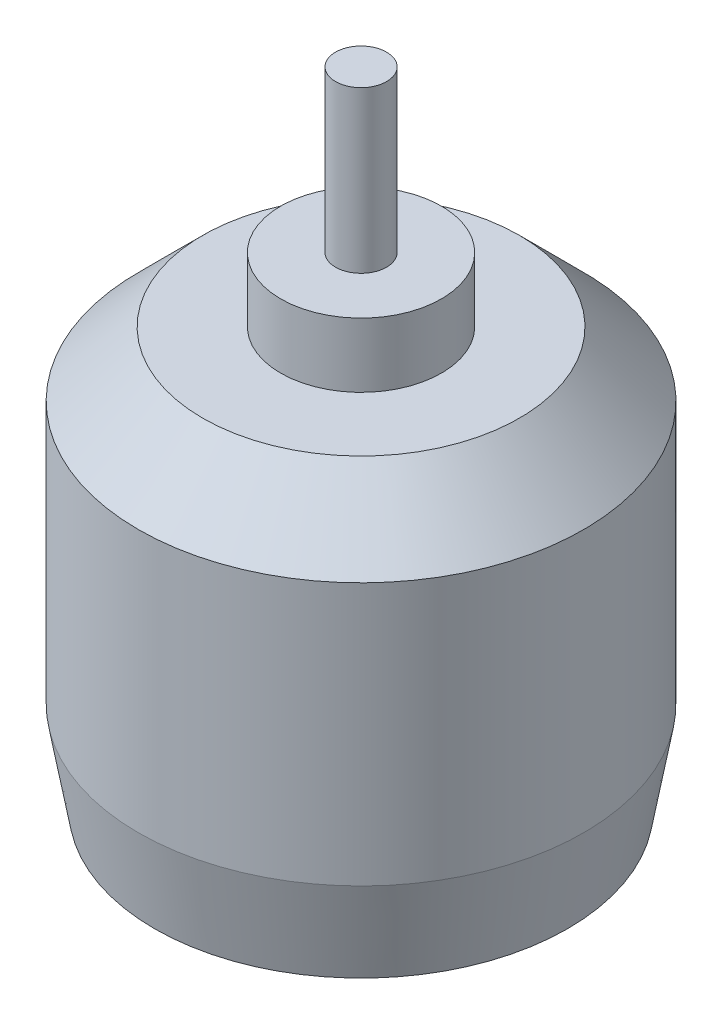
ISO-10303-21;
HEADER;
FILE_DESCRIPTION(('STEP AP214'),'2;1');
FILE_NAME('part.step','',(''),(''),'','','');
FILE_SCHEMA(('AUTOMOTIVE_DESIGN { 1 0 10303 214 1 1 1 1 }'));
ENDSEC;
DATA;
#1=APPLICATION_CONTEXT('core data for automotive mechanical design processes');
#2=APPLICATION_PROTOCOL_DEFINITION('international standard','automotive_design',2000,#1);
#3=PRODUCT_CONTEXT('',#1,'mechanical');
#4=PRODUCT('Part','Part','',(#3));
#5=PRODUCT_RELATED_PRODUCT_CATEGORY('part','',(#4));
#6=PRODUCT_DEFINITION_FORMATION('','',#4);
#7=PRODUCT_DEFINITION_CONTEXT('part definition',#1,'design');
#8=PRODUCT_DEFINITION('design','',#6,#7);
#9=PRODUCT_DEFINITION_SHAPE('','',#8);
#10=(LENGTH_UNIT() NAMED_UNIT(*) SI_UNIT(.MILLI.,.METRE.));
#11=(NAMED_UNIT(*) PLANE_ANGLE_UNIT() SI_UNIT($,.RADIAN.));
#12=(NAMED_UNIT(*) SI_UNIT($,.STERADIAN.) SOLID_ANGLE_UNIT());
#13=UNCERTAINTY_MEASURE_WITH_UNIT(LENGTH_MEASURE(1.E-05),#10,'distance_accuracy_value','');
#14=(GEOMETRIC_REPRESENTATION_CONTEXT(3) GLOBAL_UNCERTAINTY_ASSIGNED_CONTEXT((#13)) GLOBAL_UNIT_ASSIGNED_CONTEXT((#10,
#11,#12)) REPRESENTATION_CONTEXT('',''));
#15=CARTESIAN_POINT('',(0.,0.,0.));
#16=DIRECTION('',(0.,0.,1.));
#17=DIRECTION('',(1.,0.,0.));
#18=AXIS2_PLACEMENT_3D('',#15,#16,#17);
#19=CARTESIAN_POINT('',(0.,26.,0.));
#20=DIRECTION('',(0.,-1.,0.));
#21=DIRECTION('',(0.,0.,-1.));
#22=AXIS2_PLACEMENT_3D('',#19,#20,#21);
#23=CYLINDRICAL_SURFACE('',#22,13.85);
#24=CARTESIAN_POINT('',(0.,22.,0.));
#25=DIRECTION('',(0.,1.,0.));
#26=DIRECTION('',(0.,0.,1.));
#27=AXIS2_PLACEMENT_3D('',#24,#25,#26);
#28=CIRCLE('',#27,13.85);
#29=CARTESIAN_POINT('',(0.,22.,13.85));
#30=VERTEX_POINT('',#29);
#31=EDGE_CURVE('E46',#30,#30,#28,.F.);
#32=ORIENTED_EDGE('',*,*,#31,.T.);
#33=EDGE_LOOP('',(#32));
#34=FACE_BOUND('',#33,.T.);
#35=CARTESIAN_POINT('',(0.,5.67128181961862,0.));
#36=DIRECTION('',(0.,1.,0.));
#37=DIRECTION('',(0.,0.,1.));
#38=AXIS2_PLACEMENT_3D('',#35,#36,#37);
#39=CIRCLE('',#38,13.85);
#40=CARTESIAN_POINT('',(0.,5.67128181961862,13.85));
#41=VERTEX_POINT('',#40);
#42=EDGE_CURVE('E65',#41,#41,#39,.T.);
#43=ORIENTED_EDGE('',*,*,#42,.T.);
#44=EDGE_LOOP('',(#43));
#45=FACE_BOUND('',#44,.T.);
#46=ADVANCED_FACE('F41',(#34,#45),#23,.T.);
#47=CARTESIAN_POINT('',(0.,26.,0.));
#48=DIRECTION('',(0.,1.,0.));
#49=DIRECTION('',(0.,0.,1.));
#50=AXIS2_PLACEMENT_3D('',#47,#48,#49);
#51=PLANE('',#50);
#52=CARTESIAN_POINT('',(0.,26.,0.));
#53=DIRECTION('',(0.,1.,0.));
#54=DIRECTION('',(0.,0.,1.));
#55=AXIS2_PLACEMENT_3D('',#52,#53,#54);
#56=CIRCLE('',#55,5.);
#57=CARTESIAN_POINT('',(0.,26.,5.));
#58=VERTEX_POINT('',#57);
#59=EDGE_CURVE('E51',#58,#58,#56,.T.);
#60=ORIENTED_EDGE('',*,*,#59,.F.);
#61=EDGE_LOOP('',(#60));
#62=FACE_BOUND('',#61,.T.);
#63=CARTESIAN_POINT('',(0.,26.,0.));
#64=DIRECTION('',(0.,1.,0.));
#65=DIRECTION('',(0.,0.,1.));
#66=AXIS2_PLACEMENT_3D('',#63,#64,#65);
#67=CIRCLE('',#66,9.85000000000004);
#68=CARTESIAN_POINT('',(0.,26.,9.85000000000004));
#69=VERTEX_POINT('',#68);
#70=EDGE_CURVE('E73',#69,#69,#67,.T.);
#71=ORIENTED_EDGE('',*,*,#70,.T.);
#72=EDGE_LOOP('',(#71));
#73=FACE_BOUND('',#72,.T.);
#74=ADVANCED_FACE('F98',(#62,#73),#51,.T.);
#75=CARTESIAN_POINT('',(0.,0.,0.));
#76=DIRECTION('',(0.,1.,0.));
#77=DIRECTION('',(0.,0.,1.));
#78=AXIS2_PLACEMENT_3D('',#75,#76,#77);
#79=PLANE('',#78);
#80=CARTESIAN_POINT('',(0.,0.,0.));
#81=DIRECTION('',(0.,-1.,0.));
#82=DIRECTION('',(0.,0.,-1.));
#83=AXIS2_PLACEMENT_3D('',#80,#81,#82);
#84=CIRCLE('',#83,4.);
#85=CARTESIAN_POINT('',(0.,0.,-4.));
#86=VERTEX_POINT('',#85);
#87=EDGE_CURVE('E171',#86,#86,#84,.T.);
#88=ORIENTED_EDGE('',*,*,#87,.F.);
#89=EDGE_LOOP('',(#88));
#90=FACE_BOUND('',#89,.T.);
#91=CARTESIAN_POINT('',(8.,0.,0.));
#92=DIRECTION('',(0.,-1.,0.));
#93=DIRECTION('',(0.,0.,-1.));
#94=AXIS2_PLACEMENT_3D('',#91,#92,#93);
#95=CIRCLE('',#94,2.5);
#96=CARTESIAN_POINT('',(8.,0.,-2.5));
#97=VERTEX_POINT('',#96);
#98=EDGE_CURVE('E184',#97,#97,#95,.T.);
#99=ORIENTED_EDGE('',*,*,#98,.F.);
#100=EDGE_LOOP('',(#99));
#101=FACE_BOUND('',#100,.T.);
#102=CARTESIAN_POINT('',(0.,0.,9.5));
#103=DIRECTION('',(0.,-1.,0.));
#104=DIRECTION('',(0.,0.,-1.));
#105=AXIS2_PLACEMENT_3D('',#102,#103,#104);
#106=CIRCLE('',#105,2.5);
#107=CARTESIAN_POINT('',(0.,0.,7.));
#108=VERTEX_POINT('',#107);
#109=EDGE_CURVE('E192',#108,#108,#106,.T.);
#110=ORIENTED_EDGE('',*,*,#109,.F.);
#111=EDGE_LOOP('',(#110));
#112=FACE_BOUND('',#111,.T.);
#113=CARTESIAN_POINT('',(0.,0.,-9.5));
#114=DIRECTION('',(0.,-1.,0.));
#115=DIRECTION('',(0.,0.,1.));
#116=AXIS2_PLACEMENT_3D('',#113,#114,#115);
#117=CIRCLE('',#116,2.5);
#118=CARTESIAN_POINT('',(0.,0.,-7.));
#119=VERTEX_POINT('',#118);
#120=EDGE_CURVE('E200',#119,#119,#117,.T.);
#121=ORIENTED_EDGE('',*,*,#120,.F.);
#122=EDGE_LOOP('',(#121));
#123=FACE_BOUND('',#122,.T.);
#124=CARTESIAN_POINT('',(-8.,0.,0.));
#125=DIRECTION('',(0.,-1.,0.));
#126=DIRECTION('',(0.,0.,1.));
#127=AXIS2_PLACEMENT_3D('',#124,#125,#126);
#128=CIRCLE('',#127,2.5);
#129=CARTESIAN_POINT('',(-8.,0.,2.5));
#130=VERTEX_POINT('',#129);
#131=EDGE_CURVE('E170',#130,#130,#128,.T.);
#132=ORIENTED_EDGE('',*,*,#131,.F.);
#133=EDGE_LOOP('',(#132));
#134=FACE_BOUND('',#133,.T.);
#135=CARTESIAN_POINT('',(0.,0.,0.));
#136=DIRECTION('',(0.,1.,0.));
#137=DIRECTION('',(0.,0.,1.));
#138=AXIS2_PLACEMENT_3D('',#135,#136,#137);
#139=CIRCLE('',#138,12.8499999999998);
#140=CARTESIAN_POINT('',(0.,0.,12.8499999999998));
#141=VERTEX_POINT('',#140);
#142=EDGE_CURVE('E70',#141,#141,#139,.F.);
#143=ORIENTED_EDGE('',*,*,#142,.T.);
#144=EDGE_LOOP('',(#143));
#145=FACE_BOUND('',#144,.T.);
#146=ADVANCED_FACE('F95',(#90,#101,#112,#123,#134,#145),#79,.F.);
#147=CARTESIAN_POINT('',(0.,5.67128181961862,0.));
#148=DIRECTION('',(0.,1.,0.));
#149=DIRECTION('',(0.,0.,1.));
#150=AXIS2_PLACEMENT_3D('',#147,#148,#149);
#151=CONICAL_SURFACE('',#150,13.85,0.174532925199433);
#152=ORIENTED_EDGE('',*,*,#142,.F.);
#153=EDGE_LOOP('',(#152));
#154=FACE_BOUND('',#153,.T.);
#155=ORIENTED_EDGE('',*,*,#42,.F.);
#156=EDGE_LOOP('',(#155));
#157=FACE_BOUND('',#156,.T.);
#158=ADVANCED_FACE('F87',(#154,#157),#151,.T.);
#159=CARTESIAN_POINT('',(0.,26.,0.));
#160=DIRECTION('',(0.,-1.,0.));
#161=DIRECTION('',(0.,0.,-1.));
#162=AXIS2_PLACEMENT_3D('',#159,#160,#161);
#163=CONICAL_SURFACE('',#162,9.85000000000004,0.785398163397446);
#164=ORIENTED_EDGE('',*,*,#31,.F.);
#165=EDGE_LOOP('',(#164));
#166=FACE_BOUND('',#165,.T.);
#167=ORIENTED_EDGE('',*,*,#70,.F.);
#168=EDGE_LOOP('',(#167));
#169=FACE_BOUND('',#168,.T.);
#170=ADVANCED_FACE('F44',(#166,#169),#163,.T.);
#171=CARTESIAN_POINT('',(0.,30.,0.));
#172=DIRECTION('',(0.,-1.,0.));
#173=DIRECTION('',(0.,0.,-1.));
#174=AXIS2_PLACEMENT_3D('',#171,#172,#173);
#175=CYLINDRICAL_SURFACE('',#174,5.);
#176=CARTESIAN_POINT('',(0.,30.,0.));
#177=DIRECTION('',(0.,1.,0.));
#178=DIRECTION('',(0.,0.,1.));
#179=AXIS2_PLACEMENT_3D('',#176,#177,#178);
#180=CIRCLE('',#179,5.);
#181=CARTESIAN_POINT('',(0.,30.,5.));
#182=VERTEX_POINT('',#181);
#183=EDGE_CURVE('E62',#182,#182,#180,.T.);
#184=ORIENTED_EDGE('',*,*,#183,.F.);
#185=EDGE_LOOP('',(#184));
#186=FACE_BOUND('',#185,.T.);
#187=ORIENTED_EDGE('',*,*,#59,.T.);
#188=EDGE_LOOP('',(#187));
#189=FACE_BOUND('',#188,.T.);
#190=ADVANCED_FACE('F86',(#186,#189),#175,.T.);
#191=CARTESIAN_POINT('',(0.,30.,0.));
#192=DIRECTION('',(0.,1.,0.));
#193=DIRECTION('',(0.,0.,1.));
#194=AXIS2_PLACEMENT_3D('',#191,#192,#193);
#195=PLANE('',#194);
#196=CARTESIAN_POINT('',(0.,30.,0.));
#197=DIRECTION('',(0.,1.,0.));
#198=DIRECTION('',(0.,0.,1.));
#199=AXIS2_PLACEMENT_3D('',#196,#197,#198);
#200=CIRCLE('',#199,1.5875);
#201=CARTESIAN_POINT('',(0.,30.,1.5875));
#202=VERTEX_POINT('',#201);
#203=EDGE_CURVE('E10',#202,#202,#200,.T.);
#204=ORIENTED_EDGE('',*,*,#203,.F.);
#205=EDGE_LOOP('',(#204));
#206=FACE_BOUND('',#205,.T.);
#207=ORIENTED_EDGE('',*,*,#183,.T.);
#208=EDGE_LOOP('',(#207));
#209=FACE_BOUND('',#208,.T.);
#210=ADVANCED_FACE('F92',(#206,#209),#195,.T.);
#211=CARTESIAN_POINT('',(0.,40.,0.));
#212=DIRECTION('',(0.,-1.,0.));
#213=DIRECTION('',(0.,0.,-1.));
#214=AXIS2_PLACEMENT_3D('',#211,#212,#213);
#215=CYLINDRICAL_SURFACE('',#214,1.5875);
#216=CARTESIAN_POINT('',(0.,40.,0.));
#217=DIRECTION('',(0.,1.,0.));
#218=DIRECTION('',(0.,0.,1.));
#219=AXIS2_PLACEMENT_3D('',#216,#217,#218);
#220=CIRCLE('',#219,1.5875);
#221=CARTESIAN_POINT('',(0.,40.,1.5875));
#222=VERTEX_POINT('',#221);
#223=EDGE_CURVE('E60',#222,#222,#220,.T.);
#224=ORIENTED_EDGE('',*,*,#223,.F.);
#225=EDGE_LOOP('',(#224));
#226=FACE_BOUND('',#225,.T.);
#227=ORIENTED_EDGE('',*,*,#203,.T.);
#228=EDGE_LOOP('',(#227));
#229=FACE_BOUND('',#228,.T.);
#230=ADVANCED_FACE('F116',(#226,#229),#215,.T.);
#231=CARTESIAN_POINT('',(0.,40.,0.));
#232=DIRECTION('',(0.,1.,0.));
#233=DIRECTION('',(0.,0.,1.));
#234=AXIS2_PLACEMENT_3D('',#231,#232,#233);
#235=PLANE('',#234);
#236=ORIENTED_EDGE('',*,*,#223,.T.);
#237=EDGE_LOOP('',(#236));
#238=FACE_BOUND('',#237,.T.);
#239=ADVANCED_FACE('F120',(#238),#235,.T.);
#240=CARTESIAN_POINT('',(-8.,4.,0.));
#241=DIRECTION('',(0.,-1.,0.));
#242=DIRECTION('',(0.,0.,-1.));
#243=AXIS2_PLACEMENT_3D('',#240,#241,#242);
#244=CYLINDRICAL_SURFACE('',#243,2.5);
#245=CARTESIAN_POINT('',(-8.,4.,0.));
#246=DIRECTION('',(0.,-1.,0.));
#247=DIRECTION('',(0.,0.,1.));
#248=AXIS2_PLACEMENT_3D('',#245,#246,#247);
#249=CIRCLE('',#248,2.5);
#250=CARTESIAN_POINT('',(-8.,4.,2.5));
#251=VERTEX_POINT('',#250);
#252=EDGE_CURVE('E176',#251,#251,#249,.T.);
#253=ORIENTED_EDGE('',*,*,#252,.F.);
#254=EDGE_LOOP('',(#253));
#255=FACE_BOUND('',#254,.T.);
#256=ORIENTED_EDGE('',*,*,#131,.T.);
#257=EDGE_LOOP('',(#256));
#258=FACE_BOUND('',#257,.T.);
#259=ADVANCED_FACE('F124',(#255,#258),#244,.F.);
#260=CARTESIAN_POINT('',(-8.,4.,0.));
#261=DIRECTION('',(0.,1.,0.));
#262=DIRECTION('',(0.,0.,1.));
#263=AXIS2_PLACEMENT_3D('',#260,#261,#262);
#264=PLANE('',#263);
#265=ORIENTED_EDGE('',*,*,#252,.T.);
#266=EDGE_LOOP('',(#265));
#267=FACE_BOUND('',#266,.T.);
#268=ADVANCED_FACE('F128',(#267),#264,.F.);
#269=CARTESIAN_POINT('',(0.,4.,-9.5));
#270=DIRECTION('',(0.,-1.,0.));
#271=DIRECTION('',(0.,0.,-1.));
#272=AXIS2_PLACEMENT_3D('',#269,#270,#271);
#273=CYLINDRICAL_SURFACE('',#272,2.5);
#274=CARTESIAN_POINT('',(0.,4.,-9.5));
#275=DIRECTION('',(0.,-1.,0.));
#276=DIRECTION('',(0.,0.,1.));
#277=AXIS2_PLACEMENT_3D('',#274,#275,#276);
#278=CIRCLE('',#277,2.5);
#279=CARTESIAN_POINT('',(0.,4.,-7.));
#280=VERTEX_POINT('',#279);
#281=EDGE_CURVE('E196',#280,#280,#278,.T.);
#282=ORIENTED_EDGE('',*,*,#281,.F.);
#283=EDGE_LOOP('',(#282));
#284=FACE_BOUND('',#283,.T.);
#285=ORIENTED_EDGE('',*,*,#120,.T.);
#286=EDGE_LOOP('',(#285));
#287=FACE_BOUND('',#286,.T.);
#288=ADVANCED_FACE('F132',(#284,#287),#273,.F.);
#289=CARTESIAN_POINT('',(0.,4.,-9.5));
#290=DIRECTION('',(0.,1.,0.));
#291=DIRECTION('',(0.,0.,1.));
#292=AXIS2_PLACEMENT_3D('',#289,#290,#291);
#293=PLANE('',#292);
#294=ORIENTED_EDGE('',*,*,#281,.T.);
#295=EDGE_LOOP('',(#294));
#296=FACE_BOUND('',#295,.T.);
#297=ADVANCED_FACE('F136',(#296),#293,.F.);
#298=CARTESIAN_POINT('',(0.,4.,9.5));
#299=DIRECTION('',(0.,-1.,0.));
#300=DIRECTION('',(0.,0.,-1.));
#301=AXIS2_PLACEMENT_3D('',#298,#299,#300);
#302=CYLINDRICAL_SURFACE('',#301,2.5);
#303=CARTESIAN_POINT('',(0.,4.,9.5));
#304=DIRECTION('',(0.,-1.,0.));
#305=DIRECTION('',(0.,0.,-1.));
#306=AXIS2_PLACEMENT_3D('',#303,#304,#305);
#307=CIRCLE('',#306,2.5);
#308=CARTESIAN_POINT('',(0.,4.,7.));
#309=VERTEX_POINT('',#308);
#310=EDGE_CURVE('E188',#309,#309,#307,.T.);
#311=ORIENTED_EDGE('',*,*,#310,.F.);
#312=EDGE_LOOP('',(#311));
#313=FACE_BOUND('',#312,.T.);
#314=ORIENTED_EDGE('',*,*,#109,.T.);
#315=EDGE_LOOP('',(#314));
#316=FACE_BOUND('',#315,.T.);
#317=ADVANCED_FACE('F140',(#313,#316),#302,.F.);
#318=CARTESIAN_POINT('',(0.,4.,9.5));
#319=DIRECTION('',(0.,-1.,0.));
#320=DIRECTION('',(0.,0.,-1.));
#321=AXIS2_PLACEMENT_3D('',#318,#319,#320);
#322=PLANE('',#321);
#323=ORIENTED_EDGE('',*,*,#310,.T.);
#324=EDGE_LOOP('',(#323));
#325=FACE_BOUND('',#324,.T.);
#326=ADVANCED_FACE('F144',(#325),#322,.T.);
#327=CARTESIAN_POINT('',(8.,4.,0.));
#328=DIRECTION('',(0.,-1.,0.));
#329=DIRECTION('',(0.,0.,-1.));
#330=AXIS2_PLACEMENT_3D('',#327,#328,#329);
#331=CYLINDRICAL_SURFACE('',#330,2.5);
#332=CARTESIAN_POINT('',(8.,4.,0.));
#333=DIRECTION('',(0.,-1.,0.));
#334=DIRECTION('',(0.,0.,-1.));
#335=AXIS2_PLACEMENT_3D('',#332,#333,#334);
#336=CIRCLE('',#335,2.5);
#337=CARTESIAN_POINT('',(8.,4.,-2.5));
#338=VERTEX_POINT('',#337);
#339=EDGE_CURVE('E180',#338,#338,#336,.T.);
#340=ORIENTED_EDGE('',*,*,#339,.F.);
#341=EDGE_LOOP('',(#340));
#342=FACE_BOUND('',#341,.T.);
#343=ORIENTED_EDGE('',*,*,#98,.T.);
#344=EDGE_LOOP('',(#343));
#345=FACE_BOUND('',#344,.T.);
#346=ADVANCED_FACE('F148',(#342,#345),#331,.F.);
#347=CARTESIAN_POINT('',(8.,4.,0.));
#348=DIRECTION('',(0.,-1.,0.));
#349=DIRECTION('',(0.,0.,-1.));
#350=AXIS2_PLACEMENT_3D('',#347,#348,#349);
#351=PLANE('',#350);
#352=ORIENTED_EDGE('',*,*,#339,.T.);
#353=EDGE_LOOP('',(#352));
#354=FACE_BOUND('',#353,.T.);
#355=ADVANCED_FACE('F152',(#354),#351,.T.);
#356=CARTESIAN_POINT('',(0.,1.5,0.));
#357=DIRECTION('',(0.,-1.,0.));
#358=DIRECTION('',(0.,0.,-1.));
#359=AXIS2_PLACEMENT_3D('',#356,#357,#358);
#360=CYLINDRICAL_SURFACE('',#359,4.);
#361=CARTESIAN_POINT('',(0.,1.5,0.));
#362=DIRECTION('',(0.,-1.,0.));
#363=DIRECTION('',(0.,0.,-1.));
#364=AXIS2_PLACEMENT_3D('',#361,#362,#363);
#365=CIRCLE('',#364,4.);
#366=CARTESIAN_POINT('',(0.,1.5,-4.));
#367=VERTEX_POINT('',#366);
#368=EDGE_CURVE('E168',#367,#367,#365,.T.);
#369=ORIENTED_EDGE('',*,*,#368,.F.);
#370=EDGE_LOOP('',(#369));
#371=FACE_BOUND('',#370,.T.);
#372=ORIENTED_EDGE('',*,*,#87,.T.);
#373=EDGE_LOOP('',(#372));
#374=FACE_BOUND('',#373,.T.);
#375=ADVANCED_FACE('F156',(#371,#374),#360,.F.);
#376=CARTESIAN_POINT('',(0.,1.5,0.));
#377=DIRECTION('',(0.,-1.,0.));
#378=DIRECTION('',(0.,0.,-1.));
#379=AXIS2_PLACEMENT_3D('',#376,#377,#378);
#380=PLANE('',#379);
#381=ORIENTED_EDGE('',*,*,#368,.T.);
#382=EDGE_LOOP('',(#381));
#383=FACE_BOUND('',#382,.T.);
#384=ADVANCED_FACE('F160',(#383),#380,.T.);
#385=CLOSED_SHELL('',(#46,#74,#146,#158,#170,#190,#210,#230,#239,#259,#268,#288,#297,#317,#326,
#346,#355,#375,#384));
#386=MANIFOLD_SOLID_BREP('B2',#385);
#387=ADVANCED_BREP_SHAPE_REPRESENTATION('',(#18,#386),#14);
#388=SHAPE_DEFINITION_REPRESENTATION(#9,#387);
ENDSEC;
END-ISO-10303-21;
